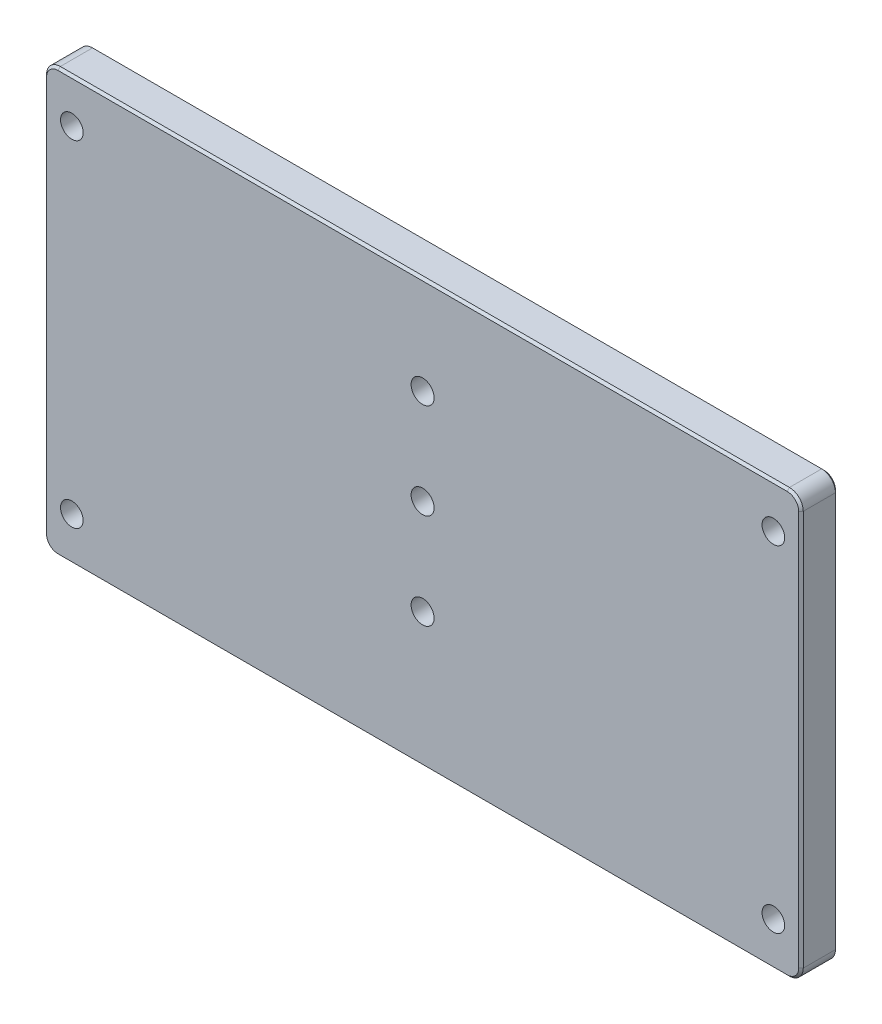
ISO-10303-21;
HEADER;
FILE_DESCRIPTION(('STEP AP214'),'2;1');
FILE_NAME('part.step','',(''),(''),'','','');
FILE_SCHEMA(('AUTOMOTIVE_DESIGN { 1 0 10303 214 1 1 1 1 }'));
ENDSEC;
DATA;
#1=APPLICATION_CONTEXT('core data for automotive mechanical design processes');
#2=APPLICATION_PROTOCOL_DEFINITION('international standard','automotive_design',2000,#1);
#3=PRODUCT_CONTEXT('',#1,'mechanical');
#4=PRODUCT('Part','Part','',(#3));
#5=PRODUCT_RELATED_PRODUCT_CATEGORY('part','',(#4));
#6=PRODUCT_DEFINITION_FORMATION('','',#4);
#7=PRODUCT_DEFINITION_CONTEXT('part definition',#1,'design');
#8=PRODUCT_DEFINITION('design','',#6,#7);
#9=PRODUCT_DEFINITION_SHAPE('','',#8);
#10=(LENGTH_UNIT() NAMED_UNIT(*) SI_UNIT(.MILLI.,.METRE.));
#11=(NAMED_UNIT(*) PLANE_ANGLE_UNIT() SI_UNIT($,.RADIAN.));
#12=(NAMED_UNIT(*) SI_UNIT($,.STERADIAN.) SOLID_ANGLE_UNIT());
#13=UNCERTAINTY_MEASURE_WITH_UNIT(LENGTH_MEASURE(1.E-05),#10,'distance_accuracy_value','');
#14=(GEOMETRIC_REPRESENTATION_CONTEXT(3) GLOBAL_UNCERTAINTY_ASSIGNED_CONTEXT((#13)) GLOBAL_UNIT_ASSIGNED_CONTEXT((#10,
#11,#12)) REPRESENTATION_CONTEXT('',''));
#15=CARTESIAN_POINT('',(0.,0.,0.));
#16=DIRECTION('',(0.,0.,1.));
#17=DIRECTION('',(1.,0.,0.));
#18=AXIS2_PLACEMENT_3D('',#15,#16,#17);
#19=CARTESIAN_POINT('',(82.25,46.,-5.));
#20=DIRECTION('',(0.,1.,0.));
#21=DIRECTION('',(0.,0.,1.));
#22=AXIS2_PLACEMENT_3D('',#19,#20,#21);
#23=PLANE('',#22);
#24=DIRECTION('',(0.,0.,1.));
#25=VECTOR('',#24,1.);
#26=CARTESIAN_POINT('',(79.25,46.,-5.));
#27=LINE('',#26,#25);
#28=CARTESIAN_POINT('',(79.25,46.,2.50000000047317));
#29=VERTEX_POINT('',#28);
#30=CARTESIAN_POINT('',(79.25,46.,-4.49999999956371));
#31=VERTEX_POINT('',#30);
#32=EDGE_CURVE('E315',#29,#31,#27,.F.);
#33=ORIENTED_EDGE('',*,*,#32,.T.);
#34=DIRECTION('',(-1.,0.,0.));
#35=VECTOR('',#34,1.);
#36=CARTESIAN_POINT('',(-79.25,46.,-4.49999999956371));
#37=LINE('',#36,#35);
#38=CARTESIAN_POINT('',(-79.25,46.,-4.49999999956371));
#39=VERTEX_POINT('',#38);
#40=EDGE_CURVE('E225',#31,#39,#37,.T.);
#41=ORIENTED_EDGE('',*,*,#40,.T.);
#42=DIRECTION('',(0.,0.,1.));
#43=VECTOR('',#42,1.);
#44=CARTESIAN_POINT('',(-79.25,46.,-5.));
#45=LINE('',#44,#43);
#46=CARTESIAN_POINT('',(-79.25,46.,2.50000000047317));
#47=VERTEX_POINT('',#46);
#48=EDGE_CURVE('E312',#39,#47,#45,.T.);
#49=ORIENTED_EDGE('',*,*,#48,.T.);
#50=DIRECTION('',(1.,0.,0.));
#51=VECTOR('',#50,1.);
#52=CARTESIAN_POINT('',(82.25,46.,2.50000000047317));
#53=LINE('',#52,#51);
#54=EDGE_CURVE('E223',#47,#29,#53,.T.);
#55=ORIENTED_EDGE('',*,*,#54,.T.);
#56=EDGE_LOOP('',(#33,#41,#49,#55));
#57=FACE_BOUND('',#56,.T.);
#58=ADVANCED_FACE('F35',(#57),#23,.T.);
#59=CARTESIAN_POINT('',(82.25,-46.,-5.));
#60=DIRECTION('',(1.,0.,0.));
#61=DIRECTION('',(0.,0.,-1.));
#62=AXIS2_PLACEMENT_3D('',#59,#60,#61);
#63=PLANE('',#62);
#64=DIRECTION('',(0.,0.,1.));
#65=VECTOR('',#64,1.);
#66=CARTESIAN_POINT('',(82.25,-43.,-5.));
#67=LINE('',#66,#65);
#68=CARTESIAN_POINT('',(82.25,-43.,2.50000000047317));
#69=VERTEX_POINT('',#68);
#70=CARTESIAN_POINT('',(82.25,-43.,-4.49999999956371));
#71=VERTEX_POINT('',#70);
#72=EDGE_CURVE('E182',#69,#71,#67,.F.);
#73=ORIENTED_EDGE('',*,*,#72,.T.);
#74=DIRECTION('',(0.,1.,0.));
#75=VECTOR('',#74,1.);
#76=CARTESIAN_POINT('',(82.25,43.,-4.49999999956371));
#77=LINE('',#76,#75);
#78=CARTESIAN_POINT('',(82.25,43.,-4.49999999956371));
#79=VERTEX_POINT('',#78);
#80=EDGE_CURVE('E157',#71,#79,#77,.T.);
#81=ORIENTED_EDGE('',*,*,#80,.T.);
#82=DIRECTION('',(0.,0.,1.));
#83=VECTOR('',#82,1.);
#84=CARTESIAN_POINT('',(82.25,43.,-5.));
#85=LINE('',#84,#83);
#86=CARTESIAN_POINT('',(82.25,43.,2.50000000047317));
#87=VERTEX_POINT('',#86);
#88=EDGE_CURVE('E180',#79,#87,#85,.T.);
#89=ORIENTED_EDGE('',*,*,#88,.T.);
#90=DIRECTION('',(0.,-1.,0.));
#91=VECTOR('',#90,1.);
#92=CARTESIAN_POINT('',(82.25,-46.,2.50000000047317));
#93=LINE('',#92,#91);
#94=EDGE_CURVE('E185',#87,#69,#93,.T.);
#95=ORIENTED_EDGE('',*,*,#94,.T.);
#96=EDGE_LOOP('',(#73,#81,#89,#95));
#97=FACE_BOUND('',#96,.T.);
#98=ADVANCED_FACE('F179',(#97),#63,.T.);
#99=CARTESIAN_POINT('',(-82.25,-46.,-5.));
#100=DIRECTION('',(0.,-1.,0.));
#101=DIRECTION('',(0.,0.,-1.));
#102=AXIS2_PLACEMENT_3D('',#99,#100,#101);
#103=PLANE('',#102);
#104=DIRECTION('',(0.,0.,1.));
#105=VECTOR('',#104,1.);
#106=CARTESIAN_POINT('',(-79.25,-46.,-5.));
#107=LINE('',#106,#105);
#108=CARTESIAN_POINT('',(-79.25,-46.,2.50000000047317));
#109=VERTEX_POINT('',#108);
#110=CARTESIAN_POINT('',(-79.25,-46.,-4.49999999956371));
#111=VERTEX_POINT('',#110);
#112=EDGE_CURVE('E192',#109,#111,#107,.F.);
#113=ORIENTED_EDGE('',*,*,#112,.T.);
#114=DIRECTION('',(1.,0.,0.));
#115=VECTOR('',#114,1.);
#116=CARTESIAN_POINT('',(79.25,-46.,-4.49999999956371));
#117=LINE('',#116,#115);
#118=CARTESIAN_POINT('',(79.25,-46.,-4.49999999956371));
#119=VERTEX_POINT('',#118);
#120=EDGE_CURVE('E221',#111,#119,#117,.T.);
#121=ORIENTED_EDGE('',*,*,#120,.T.);
#122=DIRECTION('',(0.,0.,1.));
#123=VECTOR('',#122,1.);
#124=CARTESIAN_POINT('',(79.25,-46.,-5.));
#125=LINE('',#124,#123);
#126=CARTESIAN_POINT('',(79.25,-46.,2.50000000047317));
#127=VERTEX_POINT('',#126);
#128=EDGE_CURVE('E189',#119,#127,#125,.T.);
#129=ORIENTED_EDGE('',*,*,#128,.T.);
#130=DIRECTION('',(-1.,0.,0.));
#131=VECTOR('',#130,1.);
#132=CARTESIAN_POINT('',(-82.25,-46.,2.50000000047317));
#133=LINE('',#132,#131);
#134=EDGE_CURVE('E173',#127,#109,#133,.T.);
#135=ORIENTED_EDGE('',*,*,#134,.T.);
#136=EDGE_LOOP('',(#113,#121,#129,#135));
#137=FACE_BOUND('',#136,.T.);
#138=ADVANCED_FACE('F392',(#137),#103,.T.);
#139=CARTESIAN_POINT('',(-82.25,46.,-5.));
#140=DIRECTION('',(-1.,0.,0.));
#141=DIRECTION('',(0.,0.,1.));
#142=AXIS2_PLACEMENT_3D('',#139,#140,#141);
#143=PLANE('',#142);
#144=DIRECTION('',(0.,0.,1.));
#145=VECTOR('',#144,1.);
#146=CARTESIAN_POINT('',(-82.25,43.,-5.));
#147=LINE('',#146,#145);
#148=CARTESIAN_POINT('',(-82.25,43.,2.50000000047317));
#149=VERTEX_POINT('',#148);
#150=CARTESIAN_POINT('',(-82.25,43.,-4.49999999956371));
#151=VERTEX_POINT('',#150);
#152=EDGE_CURVE('E194',#149,#151,#147,.F.);
#153=ORIENTED_EDGE('',*,*,#152,.T.);
#154=DIRECTION('',(0.,-1.,0.));
#155=VECTOR('',#154,1.);
#156=CARTESIAN_POINT('',(-82.25,-43.,-4.49999999956371));
#157=LINE('',#156,#155);
#158=CARTESIAN_POINT('',(-82.25,-43.,-4.49999999956371));
#159=VERTEX_POINT('',#158);
#160=EDGE_CURVE('E237',#151,#159,#157,.T.);
#161=ORIENTED_EDGE('',*,*,#160,.T.);
#162=DIRECTION('',(0.,0.,1.));
#163=VECTOR('',#162,1.);
#164=CARTESIAN_POINT('',(-82.25,-43.,-5.));
#165=LINE('',#164,#163);
#166=CARTESIAN_POINT('',(-82.25,-43.,2.50000000047317));
#167=VERTEX_POINT('',#166);
#168=EDGE_CURVE('E305',#159,#167,#165,.T.);
#169=ORIENTED_EDGE('',*,*,#168,.T.);
#170=DIRECTION('',(0.,1.,0.));
#171=VECTOR('',#170,1.);
#172=CARTESIAN_POINT('',(-82.25,46.,2.50000000047317));
#173=LINE('',#172,#171);
#174=EDGE_CURVE('E235',#167,#149,#173,.T.);
#175=ORIENTED_EDGE('',*,*,#174,.T.);
#176=EDGE_LOOP('',(#153,#161,#169,#175));
#177=FACE_BOUND('',#176,.T.);
#178=ADVANCED_FACE('F309',(#177),#143,.T.);
#179=CARTESIAN_POINT('',(0.,0.,-5.));
#180=DIRECTION('',(0.,0.,1.));
#181=DIRECTION('',(1.,0.,0.));
#182=AXIS2_PLACEMENT_3D('',#179,#180,#181);
#183=PLANE('',#182);
#184=CARTESIAN_POINT('',(0.,24.75,-5.));
#185=DIRECTION('',(0.,0.,1.));
#186=DIRECTION('',(1.,0.,0.));
#187=AXIS2_PLACEMENT_3D('',#184,#185,#186);
#188=CIRCLE('',#187,2.5);
#189=CARTESIAN_POINT('',(2.5,24.75,-5.));
#190=VERTEX_POINT('',#189);
#191=EDGE_CURVE('E353',#190,#190,#188,.T.);
#192=ORIENTED_EDGE('',*,*,#191,.T.);
#193=EDGE_LOOP('',(#192));
#194=FACE_BOUND('',#193,.T.);
#195=CARTESIAN_POINT('',(0.,4.,-5.));
#196=DIRECTION('',(0.,0.,1.));
#197=DIRECTION('',(1.,0.,0.));
#198=AXIS2_PLACEMENT_3D('',#195,#196,#197);
#199=CIRCLE('',#198,2.5);
#200=CARTESIAN_POINT('',(2.5,4.,-5.));
#201=VERTEX_POINT('',#200);
#202=EDGE_CURVE('E347',#201,#201,#199,.T.);
#203=ORIENTED_EDGE('',*,*,#202,.T.);
#204=EDGE_LOOP('',(#203));
#205=FACE_BOUND('',#204,.T.);
#206=CARTESIAN_POINT('',(0.,-16.75,-5.));
#207=DIRECTION('',(0.,0.,1.));
#208=DIRECTION('',(1.,0.,0.));
#209=AXIS2_PLACEMENT_3D('',#206,#207,#208);
#210=CIRCLE('',#209,2.5);
#211=CARTESIAN_POINT('',(2.50000000000001,-16.75,-5.));
#212=VERTEX_POINT('',#211);
#213=EDGE_CURVE('E271',#212,#212,#210,.T.);
#214=ORIENTED_EDGE('',*,*,#213,.T.);
#215=EDGE_LOOP('',(#214));
#216=FACE_BOUND('',#215,.T.);
#217=CARTESIAN_POINT('',(79.25,43.,-5.));
#218=DIRECTION('',(0.,0.,1.));
#219=DIRECTION('',(1.,0.,0.));
#220=AXIS2_PLACEMENT_3D('',#217,#218,#219);
#221=CIRCLE('',#220,2.50000000047322);
#222=CARTESIAN_POINT('',(79.25,45.5000000004732,-5.));
#223=VERTEX_POINT('',#222);
#224=CARTESIAN_POINT('',(81.7500000004732,43.,-5.));
#225=VERTEX_POINT('',#224);
#226=EDGE_CURVE('E210',#223,#225,#221,.F.);
#227=ORIENTED_EDGE('',*,*,#226,.T.);
#228=DIRECTION('',(0.,-1.,0.));
#229=VECTOR('',#228,1.);
#230=CARTESIAN_POINT('',(81.7500000004732,-43.,-5.));
#231=LINE('',#230,#229);
#232=CARTESIAN_POINT('',(81.7500000004732,-43.,-5.));
#233=VERTEX_POINT('',#232);
#234=EDGE_CURVE('E159',#225,#233,#231,.T.);
#235=ORIENTED_EDGE('',*,*,#234,.T.);
#236=CARTESIAN_POINT('',(79.25,-43.,-5.));
#237=DIRECTION('',(0.,0.,1.));
#238=DIRECTION('',(1.,0.,0.));
#239=AXIS2_PLACEMENT_3D('',#236,#237,#238);
#240=CIRCLE('',#239,2.50000000047321);
#241=CARTESIAN_POINT('',(79.25,-45.5000000004732,-5.));
#242=VERTEX_POINT('',#241);
#243=EDGE_CURVE('E212',#233,#242,#240,.F.);
#244=ORIENTED_EDGE('',*,*,#243,.T.);
#245=DIRECTION('',(-1.,0.,0.));
#246=VECTOR('',#245,1.);
#247=CARTESIAN_POINT('',(-79.25,-45.5000000004732,-5.));
#248=LINE('',#247,#246);
#249=CARTESIAN_POINT('',(-79.25,-45.5000000004732,-5.));
#250=VERTEX_POINT('',#249);
#251=EDGE_CURVE('E208',#242,#250,#248,.T.);
#252=ORIENTED_EDGE('',*,*,#251,.T.);
#253=CARTESIAN_POINT('',(-79.25,-43.,-5.));
#254=DIRECTION('',(0.,0.,1.));
#255=DIRECTION('',(1.,0.,0.));
#256=AXIS2_PLACEMENT_3D('',#253,#254,#255);
#257=CIRCLE('',#256,2.50000000047322);
#258=CARTESIAN_POINT('',(-81.7500000004732,-43.,-5.));
#259=VERTEX_POINT('',#258);
#260=EDGE_CURVE('E204',#250,#259,#257,.F.);
#261=ORIENTED_EDGE('',*,*,#260,.T.);
#262=DIRECTION('',(0.,1.,0.));
#263=VECTOR('',#262,1.);
#264=CARTESIAN_POINT('',(-81.7500000004732,43.,-5.));
#265=LINE('',#264,#263);
#266=CARTESIAN_POINT('',(-81.7500000004732,43.,-5.));
#267=VERTEX_POINT('',#266);
#268=EDGE_CURVE('E184',#259,#267,#265,.T.);
#269=ORIENTED_EDGE('',*,*,#268,.T.);
#270=CARTESIAN_POINT('',(-79.25,43.,-5.));
#271=DIRECTION('',(0.,0.,1.));
#272=DIRECTION('',(1.,0.,0.));
#273=AXIS2_PLACEMENT_3D('',#270,#271,#272);
#274=CIRCLE('',#273,2.50000000047321);
#275=CARTESIAN_POINT('',(-79.25,45.5000000004732,-5.));
#276=VERTEX_POINT('',#275);
#277=EDGE_CURVE('E202',#267,#276,#274,.F.);
#278=ORIENTED_EDGE('',*,*,#277,.T.);
#279=DIRECTION('',(1.,0.,0.));
#280=VECTOR('',#279,1.);
#281=CARTESIAN_POINT('',(79.25,45.5000000004732,-5.));
#282=LINE('',#281,#280);
#283=EDGE_CURVE('E206',#276,#223,#282,.T.);
#284=ORIENTED_EDGE('',*,*,#283,.T.);
#285=EDGE_LOOP('',(#227,#235,#244,#252,#261,#269,#278,#284));
#286=FACE_BOUND('',#285,.T.);
#287=CARTESIAN_POINT('',(-76.25,-36.5,-5.));
#288=DIRECTION('',(0.,0.,1.));
#289=DIRECTION('',(1.,0.,0.));
#290=AXIS2_PLACEMENT_3D('',#287,#288,#289);
#291=CIRCLE('',#290,2.45850000000002);
#292=CARTESIAN_POINT('',(-73.7915,-36.5,-5.));
#293=VERTEX_POINT('',#292);
#294=EDGE_CURVE('E337',#293,#293,#291,.T.);
#295=ORIENTED_EDGE('',*,*,#294,.T.);
#296=EDGE_LOOP('',(#295));
#297=FACE_BOUND('',#296,.T.);
#298=CARTESIAN_POINT('',(76.25,36.5,-5.));
#299=DIRECTION('',(0.,0.,1.));
#300=DIRECTION('',(1.,0.,0.));
#301=AXIS2_PLACEMENT_3D('',#298,#299,#300);
#302=CIRCLE('',#301,2.45850000000002);
#303=CARTESIAN_POINT('',(78.7085,36.5,-5.));
#304=VERTEX_POINT('',#303);
#305=EDGE_CURVE('E331',#304,#304,#302,.T.);
#306=ORIENTED_EDGE('',*,*,#305,.T.);
#307=EDGE_LOOP('',(#306));
#308=FACE_BOUND('',#307,.T.);
#309=CARTESIAN_POINT('',(76.25,-36.5,-5.));
#310=DIRECTION('',(0.,0.,-1.));
#311=DIRECTION('',(-1.,0.,0.));
#312=AXIS2_PLACEMENT_3D('',#309,#310,#311);
#313=CIRCLE('',#312,2.45850000000002);
#314=CARTESIAN_POINT('',(73.7915,-36.5,-5.));
#315=VERTEX_POINT('',#314);
#316=EDGE_CURVE('E328',#315,#315,#313,.T.);
#317=ORIENTED_EDGE('',*,*,#316,.F.);
#318=EDGE_LOOP('',(#317));
#319=FACE_BOUND('',#318,.T.);
#320=CARTESIAN_POINT('',(-76.25,36.5,-5.));
#321=DIRECTION('',(0.,0.,-1.));
#322=DIRECTION('',(-1.,0.,0.));
#323=AXIS2_PLACEMENT_3D('',#320,#321,#322);
#324=CIRCLE('',#323,2.45850000000002);
#325=CARTESIAN_POINT('',(-78.7085,36.5,-5.));
#326=VERTEX_POINT('',#325);
#327=EDGE_CURVE('E322',#326,#326,#324,.T.);
#328=ORIENTED_EDGE('',*,*,#327,.F.);
#329=EDGE_LOOP('',(#328));
#330=FACE_BOUND('',#329,.T.);
#331=ADVANCED_FACE('F366',(#194,#205,#216,#286,#297,#308,#319,#330),#183,.F.);
#332=CARTESIAN_POINT('',(0.,0.,3.));
#333=DIRECTION('',(0.,0.,1.));
#334=DIRECTION('',(1.,0.,0.));
#335=AXIS2_PLACEMENT_3D('',#332,#333,#334);
#336=PLANE('',#335);
#337=CARTESIAN_POINT('',(0.,24.75,3.));
#338=DIRECTION('',(0.,0.,1.));
#339=DIRECTION('',(1.,0.,0.));
#340=AXIS2_PLACEMENT_3D('',#337,#338,#339);
#341=CIRCLE('',#340,2.5);
#342=CARTESIAN_POINT('',(2.5,24.75,3.));
#343=VERTEX_POINT('',#342);
#344=EDGE_CURVE('E356',#343,#343,#341,.T.);
#345=ORIENTED_EDGE('',*,*,#344,.F.);
#346=EDGE_LOOP('',(#345));
#347=FACE_BOUND('',#346,.T.);
#348=CARTESIAN_POINT('',(0.,4.,3.));
#349=DIRECTION('',(0.,0.,1.));
#350=DIRECTION('',(1.,0.,0.));
#351=AXIS2_PLACEMENT_3D('',#348,#349,#350);
#352=CIRCLE('',#351,2.5);
#353=CARTESIAN_POINT('',(2.5,4.,3.));
#354=VERTEX_POINT('',#353);
#355=EDGE_CURVE('E350',#354,#354,#352,.T.);
#356=ORIENTED_EDGE('',*,*,#355,.F.);
#357=EDGE_LOOP('',(#356));
#358=FACE_BOUND('',#357,.T.);
#359=CARTESIAN_POINT('',(0.,-16.75,3.));
#360=DIRECTION('',(0.,0.,1.));
#361=DIRECTION('',(1.,0.,0.));
#362=AXIS2_PLACEMENT_3D('',#359,#360,#361);
#363=CIRCLE('',#362,2.5);
#364=CARTESIAN_POINT('',(2.50000000000001,-16.75,3.));
#365=VERTEX_POINT('',#364);
#366=EDGE_CURVE('E344',#365,#365,#363,.T.);
#367=ORIENTED_EDGE('',*,*,#366,.F.);
#368=EDGE_LOOP('',(#367));
#369=FACE_BOUND('',#368,.T.);
#370=DIRECTION('',(0.,1.,0.));
#371=VECTOR('',#370,1.);
#372=CARTESIAN_POINT('',(81.7499999995637,0.,3.));
#373=LINE('',#372,#371);
#374=CARTESIAN_POINT('',(81.7499999995637,-43.,3.));
#375=VERTEX_POINT('',#374);
#376=CARTESIAN_POINT('',(81.7499999995637,43.,3.));
#377=VERTEX_POINT('',#376);
#378=EDGE_CURVE('E59',#375,#377,#373,.T.);
#379=ORIENTED_EDGE('',*,*,#378,.T.);
#380=CARTESIAN_POINT('',(79.25,43.,3.));
#381=DIRECTION('',(0.,0.,1.));
#382=DIRECTION('',(1.,0.,0.));
#383=AXIS2_PLACEMENT_3D('',#380,#381,#382);
#384=CIRCLE('',#383,2.49999999956371);
#385=CARTESIAN_POINT('',(79.25,45.4999999995637,3.));
#386=VERTEX_POINT('',#385);
#387=EDGE_CURVE('E11',#377,#386,#384,.T.);
#388=ORIENTED_EDGE('',*,*,#387,.T.);
#389=DIRECTION('',(-1.,0.,0.));
#390=VECTOR('',#389,1.);
#391=CARTESIAN_POINT('',(0.,45.4999999995637,3.));
#392=LINE('',#391,#390);
#393=CARTESIAN_POINT('',(-79.25,45.4999999995637,3.));
#394=VERTEX_POINT('',#393);
#395=EDGE_CURVE('E44',#386,#394,#392,.T.);
#396=ORIENTED_EDGE('',*,*,#395,.T.);
#397=CARTESIAN_POINT('',(-79.25,43.,3.));
#398=DIRECTION('',(0.,0.,1.));
#399=DIRECTION('',(1.,0.,0.));
#400=AXIS2_PLACEMENT_3D('',#397,#398,#399);
#401=CIRCLE('',#400,2.4999999995637);
#402=CARTESIAN_POINT('',(-81.7499999995637,43.,3.));
#403=VERTEX_POINT('',#402);
#404=EDGE_CURVE('E247',#394,#403,#401,.T.);
#405=ORIENTED_EDGE('',*,*,#404,.T.);
#406=DIRECTION('',(0.,-1.,0.));
#407=VECTOR('',#406,1.);
#408=CARTESIAN_POINT('',(-81.7499999995637,0.,3.));
#409=LINE('',#408,#407);
#410=CARTESIAN_POINT('',(-81.7499999995637,-43.,3.));
#411=VERTEX_POINT('',#410);
#412=EDGE_CURVE('E243',#403,#411,#409,.T.);
#413=ORIENTED_EDGE('',*,*,#412,.T.);
#414=CARTESIAN_POINT('',(-79.25,-43.,3.));
#415=DIRECTION('',(0.,0.,1.));
#416=DIRECTION('',(1.,0.,0.));
#417=AXIS2_PLACEMENT_3D('',#414,#415,#416);
#418=CIRCLE('',#417,2.49999999956371);
#419=CARTESIAN_POINT('',(-79.25,-45.4999999995637,3.));
#420=VERTEX_POINT('',#419);
#421=EDGE_CURVE('E239',#411,#420,#418,.T.);
#422=ORIENTED_EDGE('',*,*,#421,.T.);
#423=DIRECTION('',(1.,0.,0.));
#424=VECTOR('',#423,1.);
#425=CARTESIAN_POINT('',(0.,-45.4999999995637,3.));
#426=LINE('',#425,#424);
#427=CARTESIAN_POINT('',(79.25,-45.4999999995637,3.));
#428=VERTEX_POINT('',#427);
#429=EDGE_CURVE('E241',#420,#428,#426,.T.);
#430=ORIENTED_EDGE('',*,*,#429,.T.);
#431=CARTESIAN_POINT('',(79.25,-43.,3.));
#432=DIRECTION('',(0.,0.,1.));
#433=DIRECTION('',(1.,0.,0.));
#434=AXIS2_PLACEMENT_3D('',#431,#432,#433);
#435=CIRCLE('',#434,2.4999999995637);
#436=EDGE_CURVE('E245',#428,#375,#435,.T.);
#437=ORIENTED_EDGE('',*,*,#436,.T.);
#438=EDGE_LOOP('',(#379,#388,#396,#405,#413,#422,#430,#437));
#439=FACE_BOUND('',#438,.T.);
#440=CARTESIAN_POINT('',(-76.25,-36.5,3.));
#441=DIRECTION('',(0.,0.,1.));
#442=DIRECTION('',(1.,0.,0.));
#443=AXIS2_PLACEMENT_3D('',#440,#441,#442);
#444=CIRCLE('',#443,2.45850000000002);
#445=CARTESIAN_POINT('',(-73.7915,-36.5,3.));
#446=VERTEX_POINT('',#445);
#447=EDGE_CURVE('E268',#446,#446,#444,.T.);
#448=ORIENTED_EDGE('',*,*,#447,.F.);
#449=EDGE_LOOP('',(#448));
#450=FACE_BOUND('',#449,.T.);
#451=CARTESIAN_POINT('',(76.25,36.5,3.));
#452=DIRECTION('',(0.,0.,1.));
#453=DIRECTION('',(1.,0.,0.));
#454=AXIS2_PLACEMENT_3D('',#451,#452,#453);
#455=CIRCLE('',#454,2.45850000000002);
#456=CARTESIAN_POINT('',(78.7085,36.5,3.));
#457=VERTEX_POINT('',#456);
#458=EDGE_CURVE('E334',#457,#457,#455,.T.);
#459=ORIENTED_EDGE('',*,*,#458,.F.);
#460=EDGE_LOOP('',(#459));
#461=FACE_BOUND('',#460,.T.);
#462=CARTESIAN_POINT('',(76.25,-36.5,3.));
#463=DIRECTION('',(0.,0.,-1.));
#464=DIRECTION('',(-1.,0.,0.));
#465=AXIS2_PLACEMENT_3D('',#462,#463,#464);
#466=CIRCLE('',#465,2.45850000000002);
#467=CARTESIAN_POINT('',(73.7915,-36.5,3.));
#468=VERTEX_POINT('',#467);
#469=EDGE_CURVE('E325',#468,#468,#466,.T.);
#470=ORIENTED_EDGE('',*,*,#469,.T.);
#471=EDGE_LOOP('',(#470));
#472=FACE_BOUND('',#471,.T.);
#473=CARTESIAN_POINT('',(-76.25,36.5,3.));
#474=DIRECTION('',(0.,0.,-1.));
#475=DIRECTION('',(-1.,0.,0.));
#476=AXIS2_PLACEMENT_3D('',#473,#474,#475);
#477=CIRCLE('',#476,2.45850000000002);
#478=CARTESIAN_POINT('',(-78.7085,36.5,3.));
#479=VERTEX_POINT('',#478);
#480=EDGE_CURVE('E319',#479,#479,#477,.T.);
#481=ORIENTED_EDGE('',*,*,#480,.T.);
#482=EDGE_LOOP('',(#481));
#483=FACE_BOUND('',#482,.T.);
#484=ADVANCED_FACE('F362',(#347,#358,#369,#439,#450,#461,#472,#483),#336,.T.);
#485=CARTESIAN_POINT('',(-76.25,36.5,-5.));
#486=DIRECTION('',(0.,0.,-1.));
#487=DIRECTION('',(-1.,0.,0.));
#488=AXIS2_PLACEMENT_3D('',#485,#486,#487);
#489=CYLINDRICAL_SURFACE('',#488,2.45850000000002);
#490=ORIENTED_EDGE('',*,*,#480,.F.);
#491=EDGE_LOOP('',(#490));
#492=FACE_BOUND('',#491,.T.);
#493=ORIENTED_EDGE('',*,*,#327,.T.);
#494=EDGE_LOOP('',(#493));
#495=FACE_BOUND('',#494,.T.);
#496=ADVANCED_FACE('F365',(#492,#495),#489,.F.);
#497=CARTESIAN_POINT('',(76.25,-36.5,-5.));
#498=DIRECTION('',(0.,0.,-1.));
#499=DIRECTION('',(-1.,0.,0.));
#500=AXIS2_PLACEMENT_3D('',#497,#498,#499);
#501=CYLINDRICAL_SURFACE('',#500,2.45850000000002);
#502=ORIENTED_EDGE('',*,*,#469,.F.);
#503=EDGE_LOOP('',(#502));
#504=FACE_BOUND('',#503,.T.);
#505=ORIENTED_EDGE('',*,*,#316,.T.);
#506=EDGE_LOOP('',(#505));
#507=FACE_BOUND('',#506,.T.);
#508=ADVANCED_FACE('F382',(#504,#507),#501,.F.);
#509=CARTESIAN_POINT('',(76.25,36.5,3.));
#510=DIRECTION('',(0.,0.,1.));
#511=DIRECTION('',(1.,0.,0.));
#512=AXIS2_PLACEMENT_3D('',#509,#510,#511);
#513=CYLINDRICAL_SURFACE('',#512,2.45850000000002);
#514=ORIENTED_EDGE('',*,*,#305,.F.);
#515=EDGE_LOOP('',(#514));
#516=FACE_BOUND('',#515,.T.);
#517=ORIENTED_EDGE('',*,*,#458,.T.);
#518=EDGE_LOOP('',(#517));
#519=FACE_BOUND('',#518,.T.);
#520=ADVANCED_FACE('F528',(#516,#519),#513,.F.);
#521=CARTESIAN_POINT('',(-76.25,-36.5,3.));
#522=DIRECTION('',(0.,0.,1.));
#523=DIRECTION('',(1.,0.,0.));
#524=AXIS2_PLACEMENT_3D('',#521,#522,#523);
#525=CYLINDRICAL_SURFACE('',#524,2.45850000000002);
#526=ORIENTED_EDGE('',*,*,#294,.F.);
#527=EDGE_LOOP('',(#526));
#528=FACE_BOUND('',#527,.T.);
#529=ORIENTED_EDGE('',*,*,#447,.T.);
#530=EDGE_LOOP('',(#529));
#531=FACE_BOUND('',#530,.T.);
#532=ADVANCED_FACE('F407',(#528,#531),#525,.F.);
#533=CARTESIAN_POINT('',(-79.25,43.,-5.));
#534=DIRECTION('',(0.,0.,1.));
#535=DIRECTION('',(1.,0.,0.));
#536=AXIS2_PLACEMENT_3D('',#533,#534,#535);
#537=CYLINDRICAL_SURFACE('',#536,3.00000000000004);
#538=ORIENTED_EDGE('',*,*,#48,.F.);
#539=CARTESIAN_POINT('',(-79.25,43.,-4.49999999956371));
#540=DIRECTION('',(0.,0.,1.));
#541=DIRECTION('',(1.,0.,0.));
#542=AXIS2_PLACEMENT_3D('',#539,#540,#541);
#543=CIRCLE('',#542,3.00000000000004);
#544=EDGE_CURVE('E233',#39,#151,#543,.T.);
#545=ORIENTED_EDGE('',*,*,#544,.T.);
#546=ORIENTED_EDGE('',*,*,#152,.F.);
#547=CARTESIAN_POINT('',(-79.25,43.,2.50000000047317));
#548=DIRECTION('',(0.,0.,1.));
#549=DIRECTION('',(1.,0.,0.));
#550=AXIS2_PLACEMENT_3D('',#547,#548,#549);
#551=CIRCLE('',#550,3.00000000000004);
#552=EDGE_CURVE('E231',#149,#47,#551,.F.);
#553=ORIENTED_EDGE('',*,*,#552,.T.);
#554=EDGE_LOOP('',(#538,#545,#546,#553));
#555=FACE_BOUND('',#554,.T.);
#556=ADVANCED_FACE('F404',(#555),#537,.T.);
#557=CARTESIAN_POINT('',(79.25,43.,-5.));
#558=DIRECTION('',(0.,0.,1.));
#559=DIRECTION('',(1.,0.,0.));
#560=AXIS2_PLACEMENT_3D('',#557,#558,#559);
#561=CYLINDRICAL_SURFACE('',#560,3.00000000000004);
#562=ORIENTED_EDGE('',*,*,#88,.F.);
#563=CARTESIAN_POINT('',(79.25,43.,-4.49999999956371));
#564=DIRECTION('',(0.,0.,1.));
#565=DIRECTION('',(1.,0.,0.));
#566=AXIS2_PLACEMENT_3D('',#563,#564,#565);
#567=CIRCLE('',#566,3.00000000000004);
#568=EDGE_CURVE('E165',#79,#31,#567,.T.);
#569=ORIENTED_EDGE('',*,*,#568,.T.);
#570=ORIENTED_EDGE('',*,*,#32,.F.);
#571=CARTESIAN_POINT('',(79.25,43.,2.50000000047317));
#572=DIRECTION('',(0.,0.,1.));
#573=DIRECTION('',(1.,0.,0.));
#574=AXIS2_PLACEMENT_3D('',#571,#572,#573);
#575=CIRCLE('',#574,3.00000000000004);
#576=EDGE_CURVE('E174',#29,#87,#575,.F.);
#577=ORIENTED_EDGE('',*,*,#576,.T.);
#578=EDGE_LOOP('',(#562,#569,#570,#577));
#579=FACE_BOUND('',#578,.T.);
#580=ADVANCED_FACE('F188',(#579),#561,.T.);
#581=CARTESIAN_POINT('',(-79.25,-43.,-5.));
#582=DIRECTION('',(0.,0.,1.));
#583=DIRECTION('',(1.,0.,0.));
#584=AXIS2_PLACEMENT_3D('',#581,#582,#583);
#585=CYLINDRICAL_SURFACE('',#584,3.00000000000004);
#586=ORIENTED_EDGE('',*,*,#168,.F.);
#587=CARTESIAN_POINT('',(-79.25,-43.,-4.49999999956371));
#588=DIRECTION('',(0.,0.,1.));
#589=DIRECTION('',(1.,0.,0.));
#590=AXIS2_PLACEMENT_3D('',#587,#588,#589);
#591=CIRCLE('',#590,3.00000000000004);
#592=EDGE_CURVE('E229',#159,#111,#591,.T.);
#593=ORIENTED_EDGE('',*,*,#592,.T.);
#594=ORIENTED_EDGE('',*,*,#112,.F.);
#595=CARTESIAN_POINT('',(-79.25,-43.,2.50000000047317));
#596=DIRECTION('',(0.,0.,1.));
#597=DIRECTION('',(1.,0.,0.));
#598=AXIS2_PLACEMENT_3D('',#595,#596,#597);
#599=CIRCLE('',#598,3.00000000000004);
#600=EDGE_CURVE('E227',#109,#167,#599,.F.);
#601=ORIENTED_EDGE('',*,*,#600,.T.);
#602=EDGE_LOOP('',(#586,#593,#594,#601));
#603=FACE_BOUND('',#602,.T.);
#604=ADVANCED_FACE('F304',(#603),#585,.T.);
#605=CARTESIAN_POINT('',(79.25,-43.,-5.));
#606=DIRECTION('',(0.,0.,1.));
#607=DIRECTION('',(1.,0.,0.));
#608=AXIS2_PLACEMENT_3D('',#605,#606,#607);
#609=CYLINDRICAL_SURFACE('',#608,3.00000000000004);
#610=ORIENTED_EDGE('',*,*,#128,.F.);
#611=CARTESIAN_POINT('',(79.25,-43.,-4.49999999956371));
#612=DIRECTION('',(0.,0.,1.));
#613=DIRECTION('',(1.,0.,0.));
#614=AXIS2_PLACEMENT_3D('',#611,#612,#613);
#615=CIRCLE('',#614,3.00000000000004);
#616=EDGE_CURVE('E217',#119,#71,#615,.T.);
#617=ORIENTED_EDGE('',*,*,#616,.T.);
#618=ORIENTED_EDGE('',*,*,#72,.F.);
#619=CARTESIAN_POINT('',(79.25,-43.,2.50000000047317));
#620=DIRECTION('',(0.,0.,1.));
#621=DIRECTION('',(1.,0.,0.));
#622=AXIS2_PLACEMENT_3D('',#619,#620,#621);
#623=CIRCLE('',#622,3.00000000000004);
#624=EDGE_CURVE('E215',#69,#127,#623,.F.);
#625=ORIENTED_EDGE('',*,*,#624,.T.);
#626=EDGE_LOOP('',(#610,#617,#618,#625));
#627=FACE_BOUND('',#626,.T.);
#628=ADVANCED_FACE('F413',(#627),#609,.T.);
#629=CARTESIAN_POINT('',(-82.25,46.,-4.49999999956371));
#630=DIRECTION('',(-0.707106781829638,0.,-0.707106780543457));
#631=DIRECTION('',(0.,1.,0.));
#632=AXIS2_PLACEMENT_3D('',#629,#630,#631);
#633=PLANE('',#632);
#634=DIRECTION('',(-0.707106780543457,0.,0.707106781829638));
#635=VECTOR('',#634,1.);
#636=CARTESIAN_POINT('',(-81.7500000004732,43.,-5.));
#637=LINE('',#636,#635);
#638=EDGE_CURVE('E262',#267,#151,#637,.T.);
#639=ORIENTED_EDGE('',*,*,#638,.F.);
#640=ORIENTED_EDGE('',*,*,#268,.F.);
#641=DIRECTION('',(0.707106780543457,0.,-0.707106781829638));
#642=VECTOR('',#641,1.);
#643=CARTESIAN_POINT('',(-82.25,-43.,-4.49999999956371));
#644=LINE('',#643,#642);
#645=EDGE_CURVE('E265',#159,#259,#644,.T.);
#646=ORIENTED_EDGE('',*,*,#645,.F.);
#647=ORIENTED_EDGE('',*,*,#160,.F.);
#648=EDGE_LOOP('',(#639,#640,#646,#647));
#649=FACE_BOUND('',#648,.T.);
#650=ADVANCED_FACE('F416',(#649),#633,.T.);
#651=CARTESIAN_POINT('',(-79.25,-43.,-5.));
#652=DIRECTION('',(0.,0.,1.));
#653=DIRECTION('',(1.,0.,0.));
#654=AXIS2_PLACEMENT_3D('',#651,#652,#653);
#655=CONICAL_SURFACE('',#654,2.50000000047322,0.785398162487977);
#656=ORIENTED_EDGE('',*,*,#645,.T.);
#657=ORIENTED_EDGE('',*,*,#260,.F.);
#658=DIRECTION('',(0.,0.707106780543452,-0.707106781829643));
#659=VECTOR('',#658,1.);
#660=CARTESIAN_POINT('',(-79.25,-46.,-4.49999999956371));
#661=LINE('',#660,#659);
#662=EDGE_CURVE('E259',#111,#250,#661,.T.);
#663=ORIENTED_EDGE('',*,*,#662,.F.);
#664=ORIENTED_EDGE('',*,*,#592,.F.);
#665=EDGE_LOOP('',(#656,#657,#663,#664));
#666=FACE_BOUND('',#665,.T.);
#667=ADVANCED_FACE('F437',(#666),#655,.T.);
#668=CARTESIAN_POINT('',(-79.25,43.,-5.));
#669=DIRECTION('',(0.,0.,1.));
#670=DIRECTION('',(1.,0.,0.));
#671=AXIS2_PLACEMENT_3D('',#668,#669,#670);
#672=CONICAL_SURFACE('',#671,2.50000000047321,0.785398162487984);
#673=ORIENTED_EDGE('',*,*,#638,.T.);
#674=ORIENTED_EDGE('',*,*,#544,.F.);
#675=DIRECTION('',(0.,0.707106780543457,0.707106781829638));
#676=VECTOR('',#675,1.);
#677=CARTESIAN_POINT('',(-79.25,45.5000000004732,-5.));
#678=LINE('',#677,#676);
#679=EDGE_CURVE('E256',#276,#39,#678,.T.);
#680=ORIENTED_EDGE('',*,*,#679,.F.);
#681=ORIENTED_EDGE('',*,*,#277,.F.);
#682=EDGE_LOOP('',(#673,#674,#680,#681));
#683=FACE_BOUND('',#682,.T.);
#684=ADVANCED_FACE('F433',(#683),#672,.T.);
#685=CARTESIAN_POINT('',(-82.25,-46.,-4.49999999956371));
#686=DIRECTION('',(0.,-0.707106781829638,-0.707106780543457));
#687=DIRECTION('',(-1.,0.,0.));
#688=AXIS2_PLACEMENT_3D('',#685,#686,#687);
#689=PLANE('',#688);
#690=ORIENTED_EDGE('',*,*,#662,.T.);
#691=ORIENTED_EDGE('',*,*,#251,.F.);
#692=DIRECTION('',(0.,0.707106780543457,-0.707106781829638));
#693=VECTOR('',#692,1.);
#694=CARTESIAN_POINT('',(79.25,-46.,-4.49999999956371));
#695=LINE('',#694,#693);
#696=EDGE_CURVE('E253',#119,#242,#695,.T.);
#697=ORIENTED_EDGE('',*,*,#696,.F.);
#698=ORIENTED_EDGE('',*,*,#120,.F.);
#699=EDGE_LOOP('',(#690,#691,#697,#698));
#700=FACE_BOUND('',#699,.T.);
#701=ADVANCED_FACE('F429',(#700),#689,.T.);
#702=CARTESIAN_POINT('',(82.25,46.,-4.49999999956371));
#703=DIRECTION('',(0.,0.707106781829638,-0.707106780543457));
#704=DIRECTION('',(1.,0.,0.));
#705=AXIS2_PLACEMENT_3D('',#702,#703,#704);
#706=PLANE('',#705);
#707=ORIENTED_EDGE('',*,*,#679,.T.);
#708=ORIENTED_EDGE('',*,*,#40,.F.);
#709=DIRECTION('',(0.,0.707106780543457,0.707106781829638));
#710=VECTOR('',#709,1.);
#711=CARTESIAN_POINT('',(79.25,45.5000000004732,-5.));
#712=LINE('',#711,#710);
#713=EDGE_CURVE('E168',#223,#31,#712,.T.);
#714=ORIENTED_EDGE('',*,*,#713,.F.);
#715=ORIENTED_EDGE('',*,*,#283,.F.);
#716=EDGE_LOOP('',(#707,#708,#714,#715));
#717=FACE_BOUND('',#716,.T.);
#718=ADVANCED_FACE('F425',(#717),#706,.T.);
#719=CARTESIAN_POINT('',(79.25,-43.,-5.));
#720=DIRECTION('',(0.,0.,1.));
#721=DIRECTION('',(1.,0.,0.));
#722=AXIS2_PLACEMENT_3D('',#719,#720,#721);
#723=CONICAL_SURFACE('',#722,2.50000000047321,0.785398162487984);
#724=ORIENTED_EDGE('',*,*,#696,.T.);
#725=ORIENTED_EDGE('',*,*,#243,.F.);
#726=DIRECTION('',(-0.707106780543467,0.,-0.707106781829628));
#727=VECTOR('',#726,1.);
#728=CARTESIAN_POINT('',(82.25,-43.,-4.49999999956371));
#729=LINE('',#728,#727);
#730=EDGE_CURVE('E162',#71,#233,#729,.T.);
#731=ORIENTED_EDGE('',*,*,#730,.F.);
#732=ORIENTED_EDGE('',*,*,#616,.F.);
#733=EDGE_LOOP('',(#724,#725,#731,#732));
#734=FACE_BOUND('',#733,.T.);
#735=ADVANCED_FACE('F422',(#734),#723,.T.);
#736=CARTESIAN_POINT('',(79.25,43.,-5.));
#737=DIRECTION('',(0.,0.,1.));
#738=DIRECTION('',(1.,0.,0.));
#739=AXIS2_PLACEMENT_3D('',#736,#737,#738);
#740=CONICAL_SURFACE('',#739,2.50000000047322,0.785398162487977);
#741=ORIENTED_EDGE('',*,*,#713,.T.);
#742=ORIENTED_EDGE('',*,*,#568,.F.);
#743=DIRECTION('',(0.707106780543457,0.,0.707106781829638));
#744=VECTOR('',#743,1.);
#745=CARTESIAN_POINT('',(81.7500000004732,43.,-5.));
#746=LINE('',#745,#744);
#747=EDGE_CURVE('E153',#225,#79,#746,.T.);
#748=ORIENTED_EDGE('',*,*,#747,.F.);
#749=ORIENTED_EDGE('',*,*,#226,.F.);
#750=EDGE_LOOP('',(#741,#742,#748,#749));
#751=FACE_BOUND('',#750,.T.);
#752=ADVANCED_FACE('F166',(#751),#740,.T.);
#753=CARTESIAN_POINT('',(82.25,-46.,-4.49999999956371));
#754=DIRECTION('',(0.707106781829638,0.,-0.707106780543457));
#755=DIRECTION('',(0.,-1.,0.));
#756=AXIS2_PLACEMENT_3D('',#753,#754,#755);
#757=PLANE('',#756);
#758=ORIENTED_EDGE('',*,*,#730,.T.);
#759=ORIENTED_EDGE('',*,*,#234,.F.);
#760=ORIENTED_EDGE('',*,*,#747,.T.);
#761=ORIENTED_EDGE('',*,*,#80,.F.);
#762=EDGE_LOOP('',(#758,#759,#760,#761));
#763=FACE_BOUND('',#762,.T.);
#764=ADVANCED_FACE('F155',(#763),#757,.T.);
#765=CARTESIAN_POINT('',(-79.25,-43.,3.));
#766=DIRECTION('',(0.,0.,-1.));
#767=DIRECTION('',(-1.,0.,0.));
#768=AXIS2_PLACEMENT_3D('',#765,#766,#767);
#769=CONICAL_SURFACE('',#768,2.49999999956371,0.785398164306944);
#770=DIRECTION('',(0.707106781829661,0.,0.707106780543434));
#771=VECTOR('',#770,1.);
#772=CARTESIAN_POINT('',(-82.25,-43.,2.50000000047317));
#773=LINE('',#772,#771);
#774=EDGE_CURVE('E284',#167,#411,#773,.T.);
#775=ORIENTED_EDGE('',*,*,#774,.F.);
#776=ORIENTED_EDGE('',*,*,#600,.F.);
#777=DIRECTION('',(0.,-0.707106781829656,-0.707106780543439));
#778=VECTOR('',#777,1.);
#779=CARTESIAN_POINT('',(-79.25,-45.4999999995637,3.));
#780=LINE('',#779,#778);
#781=EDGE_CURVE('E39',#420,#109,#780,.T.);
#782=ORIENTED_EDGE('',*,*,#781,.F.);
#783=ORIENTED_EDGE('',*,*,#421,.F.);
#784=EDGE_LOOP('',(#775,#776,#782,#783));
#785=FACE_BOUND('',#784,.T.);
#786=ADVANCED_FACE('F37',(#785),#769,.T.);
#787=CARTESIAN_POINT('',(0.,-45.4999999995637,3.));
#788=DIRECTION('',(0.,0.707106780543434,-0.707106781829661));
#789=DIRECTION('',(1.,0.,0.));
#790=AXIS2_PLACEMENT_3D('',#787,#788,#789);
#791=PLANE('',#790);
#792=ORIENTED_EDGE('',*,*,#781,.T.);
#793=ORIENTED_EDGE('',*,*,#134,.F.);
#794=DIRECTION('',(0.,-0.707106781829661,-0.707106780543434));
#795=VECTOR('',#794,1.);
#796=CARTESIAN_POINT('',(79.25,-45.4999999995637,3.));
#797=LINE('',#796,#795);
#798=EDGE_CURVE('E282',#428,#127,#797,.T.);
#799=ORIENTED_EDGE('',*,*,#798,.F.);
#800=ORIENTED_EDGE('',*,*,#429,.F.);
#801=EDGE_LOOP('',(#792,#793,#799,#800));
#802=FACE_BOUND('',#801,.T.);
#803=ADVANCED_FACE('F295',(#802),#791,.F.);
#804=CARTESIAN_POINT('',(-81.7499999995637,0.,3.));
#805=DIRECTION('',(0.707106780543434,0.,-0.707106781829661));
#806=DIRECTION('',(0.,-1.,0.));
#807=AXIS2_PLACEMENT_3D('',#804,#805,#806);
#808=PLANE('',#807);
#809=ORIENTED_EDGE('',*,*,#774,.T.);
#810=ORIENTED_EDGE('',*,*,#412,.F.);
#811=DIRECTION('',(0.707106781829661,0.,0.707106780543434));
#812=VECTOR('',#811,1.);
#813=CARTESIAN_POINT('',(-82.25,43.,2.50000000047317));
#814=LINE('',#813,#812);
#815=EDGE_CURVE('E279',#149,#403,#814,.T.);
#816=ORIENTED_EDGE('',*,*,#815,.F.);
#817=ORIENTED_EDGE('',*,*,#174,.F.);
#818=EDGE_LOOP('',(#809,#810,#816,#817));
#819=FACE_BOUND('',#818,.T.);
#820=ADVANCED_FACE('F464',(#819),#808,.F.);
#821=CARTESIAN_POINT('',(79.25,-43.,3.));
#822=DIRECTION('',(0.,0.,-1.));
#823=DIRECTION('',(-1.,0.,0.));
#824=AXIS2_PLACEMENT_3D('',#821,#822,#823);
#825=CONICAL_SURFACE('',#824,2.49999999956371,0.785398164306951);
#826=ORIENTED_EDGE('',*,*,#798,.T.);
#827=ORIENTED_EDGE('',*,*,#624,.F.);
#828=DIRECTION('',(0.707106781829671,0.,-0.707106780543424));
#829=VECTOR('',#828,1.);
#830=CARTESIAN_POINT('',(81.7499999995637,-43.,3.));
#831=LINE('',#830,#829);
#832=EDGE_CURVE('E276',#375,#69,#831,.T.);
#833=ORIENTED_EDGE('',*,*,#832,.F.);
#834=ORIENTED_EDGE('',*,*,#436,.F.);
#835=EDGE_LOOP('',(#826,#827,#833,#834));
#836=FACE_BOUND('',#835,.T.);
#837=ADVANCED_FACE('F460',(#836),#825,.T.);
#838=CARTESIAN_POINT('',(-79.25,43.,3.));
#839=DIRECTION('',(0.,0.,-1.));
#840=DIRECTION('',(-1.,0.,0.));
#841=AXIS2_PLACEMENT_3D('',#838,#839,#840);
#842=CONICAL_SURFACE('',#841,2.49999999956371,0.785398164306951);
#843=ORIENTED_EDGE('',*,*,#815,.T.);
#844=ORIENTED_EDGE('',*,*,#404,.F.);
#845=DIRECTION('',(0.,-0.707106781829666,0.707106780543429));
#846=VECTOR('',#845,1.);
#847=CARTESIAN_POINT('',(-79.25,46.,2.50000000047317));
#848=LINE('',#847,#846);
#849=EDGE_CURVE('E273',#47,#394,#848,.T.);
#850=ORIENTED_EDGE('',*,*,#849,.F.);
#851=ORIENTED_EDGE('',*,*,#552,.F.);
#852=EDGE_LOOP('',(#843,#844,#850,#851));
#853=FACE_BOUND('',#852,.T.);
#854=ADVANCED_FACE('F456',(#853),#842,.T.);
#855=CARTESIAN_POINT('',(81.7499999995637,0.,3.));
#856=DIRECTION('',(-0.707106780543434,0.,-0.707106781829661));
#857=DIRECTION('',(0.,1.,0.));
#858=AXIS2_PLACEMENT_3D('',#855,#856,#857);
#859=PLANE('',#858);
#860=ORIENTED_EDGE('',*,*,#832,.T.);
#861=ORIENTED_EDGE('',*,*,#94,.F.);
#862=DIRECTION('',(0.707106781829661,0.,-0.707106780543434));
#863=VECTOR('',#862,1.);
#864=CARTESIAN_POINT('',(81.7499999995637,43.,3.));
#865=LINE('',#864,#863);
#866=EDGE_CURVE('E270',#377,#87,#865,.T.);
#867=ORIENTED_EDGE('',*,*,#866,.F.);
#868=ORIENTED_EDGE('',*,*,#378,.F.);
#869=EDGE_LOOP('',(#860,#861,#867,#868));
#870=FACE_BOUND('',#869,.T.);
#871=ADVANCED_FACE('F452',(#870),#859,.F.);
#872=CARTESIAN_POINT('',(0.,45.4999999995637,3.));
#873=DIRECTION('',(0.,-0.707106780543434,-0.707106781829661));
#874=DIRECTION('',(-1.,0.,0.));
#875=AXIS2_PLACEMENT_3D('',#872,#873,#874);
#876=PLANE('',#875);
#877=ORIENTED_EDGE('',*,*,#849,.T.);
#878=ORIENTED_EDGE('',*,*,#395,.F.);
#879=DIRECTION('',(0.,-0.707106781829661,0.707106780543434));
#880=VECTOR('',#879,1.);
#881=CARTESIAN_POINT('',(79.25,46.,2.50000000047317));
#882=LINE('',#881,#880);
#883=EDGE_CURVE('E52',#29,#386,#882,.T.);
#884=ORIENTED_EDGE('',*,*,#883,.F.);
#885=ORIENTED_EDGE('',*,*,#54,.F.);
#886=EDGE_LOOP('',(#877,#878,#884,#885));
#887=FACE_BOUND('',#886,.T.);
#888=ADVANCED_FACE('F449',(#887),#876,.F.);
#889=CARTESIAN_POINT('',(79.25,43.,3.));
#890=DIRECTION('',(0.,0.,-1.));
#891=DIRECTION('',(-1.,0.,0.));
#892=AXIS2_PLACEMENT_3D('',#889,#890,#891);
#893=CONICAL_SURFACE('',#892,2.49999999956371,0.785398164306944);
#894=ORIENTED_EDGE('',*,*,#866,.T.);
#895=ORIENTED_EDGE('',*,*,#576,.F.);
#896=ORIENTED_EDGE('',*,*,#883,.T.);
#897=ORIENTED_EDGE('',*,*,#387,.F.);
#898=EDGE_LOOP('',(#894,#895,#896,#897));
#899=FACE_BOUND('',#898,.T.);
#900=ADVANCED_FACE('F445',(#899),#893,.T.);
#901=CARTESIAN_POINT('',(0.,-16.75,3.));
#902=DIRECTION('',(0.,0.,1.));
#903=DIRECTION('',(1.,0.,0.));
#904=AXIS2_PLACEMENT_3D('',#901,#902,#903);
#905=CYLINDRICAL_SURFACE('',#904,2.5);
#906=ORIENTED_EDGE('',*,*,#213,.F.);
#907=EDGE_LOOP('',(#906));
#908=FACE_BOUND('',#907,.T.);
#909=ORIENTED_EDGE('',*,*,#366,.T.);
#910=EDGE_LOOP('',(#909));
#911=FACE_BOUND('',#910,.T.);
#912=ADVANCED_FACE('F448',(#908,#911),#905,.F.);
#913=CARTESIAN_POINT('',(0.,4.,3.));
#914=DIRECTION('',(0.,0.,1.));
#915=DIRECTION('',(1.,0.,0.));
#916=AXIS2_PLACEMENT_3D('',#913,#914,#915);
#917=CYLINDRICAL_SURFACE('',#916,2.5);
#918=ORIENTED_EDGE('',*,*,#202,.F.);
#919=EDGE_LOOP('',(#918));
#920=FACE_BOUND('',#919,.T.);
#921=ORIENTED_EDGE('',*,*,#355,.T.);
#922=EDGE_LOOP('',(#921));
#923=FACE_BOUND('',#922,.T.);
#924=ADVANCED_FACE('F566',(#920,#923),#917,.F.);
#925=CARTESIAN_POINT('',(0.,24.75,3.));
#926=DIRECTION('',(0.,0.,1.));
#927=DIRECTION('',(1.,0.,0.));
#928=AXIS2_PLACEMENT_3D('',#925,#926,#927);
#929=CYLINDRICAL_SURFACE('',#928,2.5);
#930=ORIENTED_EDGE('',*,*,#191,.F.);
#931=EDGE_LOOP('',(#930));
#932=FACE_BOUND('',#931,.T.);
#933=ORIENTED_EDGE('',*,*,#344,.T.);
#934=EDGE_LOOP('',(#933));
#935=FACE_BOUND('',#934,.T.);
#936=ADVANCED_FACE('F360',(#932,#935),#929,.F.);
#937=CLOSED_SHELL('',(#58,#98,#138,#178,#331,#484,#496,#508,#520,#532,#556,#580,#604,#628,#650,
#667,#684,#701,#718,#735,#752,#764,#786,#803,#820,#837,#854,#871,#888,#900,#912,#924,#936));
#938=MANIFOLD_SOLID_BREP('B2',#937);
#939=ADVANCED_BREP_SHAPE_REPRESENTATION('',(#18,#938),#14);
#940=SHAPE_DEFINITION_REPRESENTATION(#9,#939);
ENDSEC;
END-ISO-10303-21;
